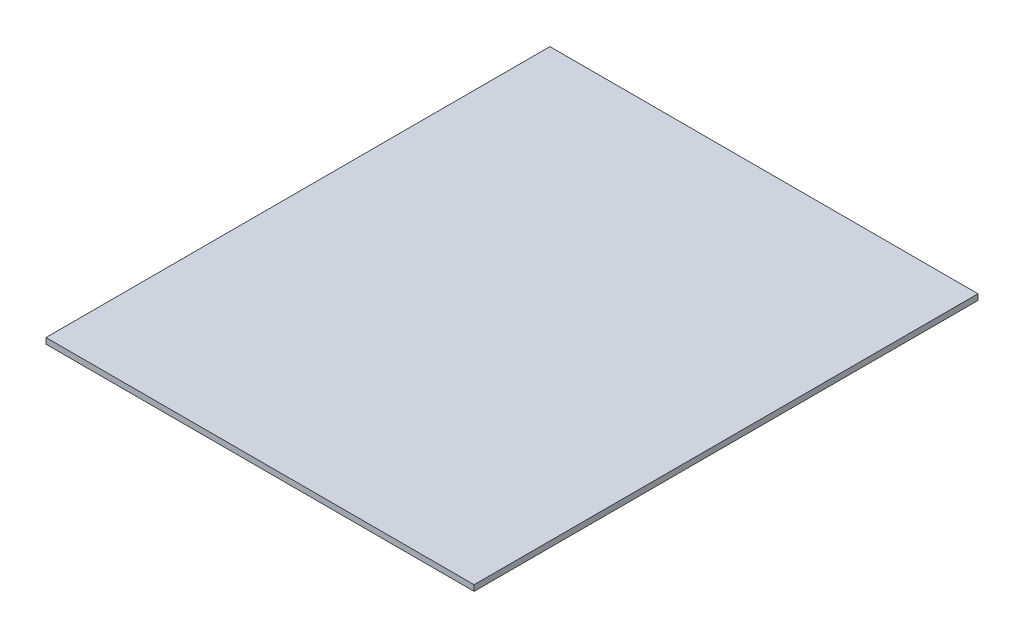
ISO-10303-21;
HEADER;
FILE_DESCRIPTION(('STEP AP214'),'2;1');
FILE_NAME('part.step','',(''),(''),'','','');
FILE_SCHEMA(('AUTOMOTIVE_DESIGN { 1 0 10303 214 1 1 1 1 }'));
ENDSEC;
DATA;
#1=APPLICATION_CONTEXT('core data for automotive mechanical design processes');
#2=APPLICATION_PROTOCOL_DEFINITION('international standard','automotive_design',2000,#1);
#3=PRODUCT_CONTEXT('',#1,'mechanical');
#4=PRODUCT('Part','Part','',(#3));
#5=PRODUCT_RELATED_PRODUCT_CATEGORY('part','',(#4));
#6=PRODUCT_DEFINITION_FORMATION('','',#4);
#7=PRODUCT_DEFINITION_CONTEXT('part definition',#1,'design');
#8=PRODUCT_DEFINITION('design','',#6,#7);
#9=PRODUCT_DEFINITION_SHAPE('','',#8);
#10=(LENGTH_UNIT() NAMED_UNIT(*) SI_UNIT(.MILLI.,.METRE.));
#11=(NAMED_UNIT(*) PLANE_ANGLE_UNIT() SI_UNIT($,.RADIAN.));
#12=(NAMED_UNIT(*) SI_UNIT($,.STERADIAN.) SOLID_ANGLE_UNIT());
#13=UNCERTAINTY_MEASURE_WITH_UNIT(LENGTH_MEASURE(1.E-05),#10,'distance_accuracy_value','');
#14=(GEOMETRIC_REPRESENTATION_CONTEXT(3) GLOBAL_UNCERTAINTY_ASSIGNED_CONTEXT((#13)) GLOBAL_UNIT_ASSIGNED_CONTEXT((#10,
#11,#12)) REPRESENTATION_CONTEXT('',''));
#15=CARTESIAN_POINT('',(0.,0.,0.));
#16=DIRECTION('',(0.,0.,1.));
#17=DIRECTION('',(1.,0.,0.));
#18=AXIS2_PLACEMENT_3D('',#15,#16,#17);
#19=CARTESIAN_POINT('',(-110.5,333.,134.624897978768));
#20=DIRECTION('',(1.,0.,0.));
#21=DIRECTION('',(0.,0.,-1.));
#22=AXIS2_PLACEMENT_3D('',#19,#20,#21);
#23=PLANE('',#22);
#24=DIRECTION('',(0.,0.,1.));
#25=VECTOR('',#24,1.);
#26=CARTESIAN_POINT('',(-110.5,330.,134.624897978768));
#27=LINE('',#26,#25);
#28=CARTESIAN_POINT('',(-110.5,330.,-125.5));
#29=VERTEX_POINT('',#28);
#30=CARTESIAN_POINT('',(-110.5,330.,134.624897978768));
#31=VERTEX_POINT('',#30);
#32=EDGE_CURVE('E100',#29,#31,#27,.T.);
#33=ORIENTED_EDGE('',*,*,#32,.T.);
#34=DIRECTION('',(0.,-1.,0.));
#35=VECTOR('',#34,1.);
#36=CARTESIAN_POINT('',(-110.5,333.,134.624897978768));
#37=LINE('',#36,#35);
#38=CARTESIAN_POINT('',(-110.5,333.,134.624897978768));
#39=VERTEX_POINT('',#38);
#40=EDGE_CURVE('E11',#39,#31,#37,.T.);
#41=ORIENTED_EDGE('',*,*,#40,.F.);
#42=DIRECTION('',(0.,0.,1.));
#43=VECTOR('',#42,1.);
#44=CARTESIAN_POINT('',(-110.5,333.,134.624897978768));
#45=LINE('',#44,#43);
#46=CARTESIAN_POINT('',(-110.5,333.,-125.5));
#47=VERTEX_POINT('',#46);
#48=EDGE_CURVE('E88',#47,#39,#45,.T.);
#49=ORIENTED_EDGE('',*,*,#48,.F.);
#50=DIRECTION('',(0.,-1.,0.));
#51=VECTOR('',#50,1.);
#52=CARTESIAN_POINT('',(-110.5,333.,-125.5));
#53=LINE('',#52,#51);
#54=EDGE_CURVE('E96',#47,#29,#53,.T.);
#55=ORIENTED_EDGE('',*,*,#54,.T.);
#56=EDGE_LOOP('',(#33,#41,#49,#55));
#57=FACE_BOUND('',#56,.T.);
#58=ADVANCED_FACE('F37',(#57),#23,.F.);
#59=CARTESIAN_POINT('',(110.5,333.,134.624897978768));
#60=DIRECTION('',(0.,0.,-1.));
#61=DIRECTION('',(-1.,0.,0.));
#62=AXIS2_PLACEMENT_3D('',#59,#60,#61);
#63=PLANE('',#62);
#64=DIRECTION('',(1.,0.,0.));
#65=VECTOR('',#64,1.);
#66=CARTESIAN_POINT('',(110.5,330.,134.624897978768));
#67=LINE('',#66,#65);
#68=CARTESIAN_POINT('',(110.5,330.,134.624897978768));
#69=VERTEX_POINT('',#68);
#70=EDGE_CURVE('E92',#31,#69,#67,.T.);
#71=ORIENTED_EDGE('',*,*,#70,.T.);
#72=DIRECTION('',(0.,-1.,0.));
#73=VECTOR('',#72,1.);
#74=CARTESIAN_POINT('',(110.5,333.,134.624897978768));
#75=LINE('',#74,#73);
#76=CARTESIAN_POINT('',(110.5,333.,134.624897978768));
#77=VERTEX_POINT('',#76);
#78=EDGE_CURVE('E45',#77,#69,#75,.T.);
#79=ORIENTED_EDGE('',*,*,#78,.F.);
#80=DIRECTION('',(1.,0.,0.));
#81=VECTOR('',#80,1.);
#82=CARTESIAN_POINT('',(110.5,333.,134.624897978768));
#83=LINE('',#82,#81);
#84=EDGE_CURVE('E83',#39,#77,#83,.T.);
#85=ORIENTED_EDGE('',*,*,#84,.F.);
#86=ORIENTED_EDGE('',*,*,#40,.T.);
#87=EDGE_LOOP('',(#71,#79,#85,#86));
#88=FACE_BOUND('',#87,.T.);
#89=ADVANCED_FACE('F91',(#88),#63,.F.);
#90=CARTESIAN_POINT('',(110.5,333.,-125.5));
#91=DIRECTION('',(-1.,0.,0.));
#92=DIRECTION('',(0.,0.,1.));
#93=AXIS2_PLACEMENT_3D('',#90,#91,#92);
#94=PLANE('',#93);
#95=DIRECTION('',(0.,0.,-1.));
#96=VECTOR('',#95,1.);
#97=CARTESIAN_POINT('',(110.5,330.,-125.5));
#98=LINE('',#97,#96);
#99=CARTESIAN_POINT('',(110.5,330.,-125.5));
#100=VERTEX_POINT('',#99);
#101=EDGE_CURVE('E70',#69,#100,#98,.T.);
#102=ORIENTED_EDGE('',*,*,#101,.T.);
#103=DIRECTION('',(0.,-1.,0.));
#104=VECTOR('',#103,1.);
#105=CARTESIAN_POINT('',(110.5,333.,-125.5));
#106=LINE('',#105,#104);
#107=CARTESIAN_POINT('',(110.5,333.,-125.5));
#108=VERTEX_POINT('',#107);
#109=EDGE_CURVE('E93',#108,#100,#106,.T.);
#110=ORIENTED_EDGE('',*,*,#109,.F.);
#111=DIRECTION('',(0.,0.,-1.));
#112=VECTOR('',#111,1.);
#113=CARTESIAN_POINT('',(110.5,333.,-125.5));
#114=LINE('',#113,#112);
#115=EDGE_CURVE('E86',#77,#108,#114,.T.);
#116=ORIENTED_EDGE('',*,*,#115,.F.);
#117=ORIENTED_EDGE('',*,*,#78,.T.);
#118=EDGE_LOOP('',(#102,#110,#116,#117));
#119=FACE_BOUND('',#118,.T.);
#120=ADVANCED_FACE('F94',(#119),#94,.F.);
#121=CARTESIAN_POINT('',(-110.5,333.,-125.5));
#122=DIRECTION('',(0.,0.,1.));
#123=DIRECTION('',(1.,0.,0.));
#124=AXIS2_PLACEMENT_3D('',#121,#122,#123);
#125=PLANE('',#124);
#126=DIRECTION('',(-1.,0.,0.));
#127=VECTOR('',#126,1.);
#128=CARTESIAN_POINT('',(-110.5,330.,-125.5));
#129=LINE('',#128,#127);
#130=EDGE_CURVE('E76',#100,#29,#129,.T.);
#131=ORIENTED_EDGE('',*,*,#130,.T.);
#132=ORIENTED_EDGE('',*,*,#54,.F.);
#133=DIRECTION('',(-1.,0.,0.));
#134=VECTOR('',#133,1.);
#135=CARTESIAN_POINT('',(-110.5,333.,-125.5));
#136=LINE('',#135,#134);
#137=EDGE_CURVE('E53',#108,#47,#136,.T.);
#138=ORIENTED_EDGE('',*,*,#137,.F.);
#139=ORIENTED_EDGE('',*,*,#109,.T.);
#140=EDGE_LOOP('',(#131,#132,#138,#139));
#141=FACE_BOUND('',#140,.T.);
#142=ADVANCED_FACE('F107',(#141),#125,.F.);
#143=CARTESIAN_POINT('',(0.,333.,0.));
#144=DIRECTION('',(0.,-1.,0.));
#145=DIRECTION('',(0.,0.,-1.));
#146=AXIS2_PLACEMENT_3D('',#143,#144,#145);
#147=PLANE('',#146);
#148=ORIENTED_EDGE('',*,*,#48,.T.);
#149=ORIENTED_EDGE('',*,*,#84,.T.);
#150=ORIENTED_EDGE('',*,*,#115,.T.);
#151=ORIENTED_EDGE('',*,*,#137,.T.);
#152=EDGE_LOOP('',(#148,#149,#150,#151));
#153=FACE_BOUND('',#152,.T.);
#154=ADVANCED_FACE('F84',(#153),#147,.F.);
#155=CARTESIAN_POINT('',(0.,330.,0.));
#156=DIRECTION('',(0.,-1.,0.));
#157=DIRECTION('',(0.,0.,-1.));
#158=AXIS2_PLACEMENT_3D('',#155,#156,#157);
#159=PLANE('',#158);
#160=ORIENTED_EDGE('',*,*,#32,.F.);
#161=ORIENTED_EDGE('',*,*,#130,.F.);
#162=ORIENTED_EDGE('',*,*,#101,.F.);
#163=ORIENTED_EDGE('',*,*,#70,.F.);
#164=EDGE_LOOP('',(#160,#161,#162,#163));
#165=FACE_BOUND('',#164,.T.);
#166=ADVANCED_FACE('F110',(#165),#159,.T.);
#167=CLOSED_SHELL('',(#58,#89,#120,#142,#154,#166));
#168=MANIFOLD_SOLID_BREP('B2',#167);
#169=ADVANCED_BREP_SHAPE_REPRESENTATION('',(#18,#168),#14);
#170=SHAPE_DEFINITION_REPRESENTATION(#9,#169);
ENDSEC;
END-ISO-10303-21;
